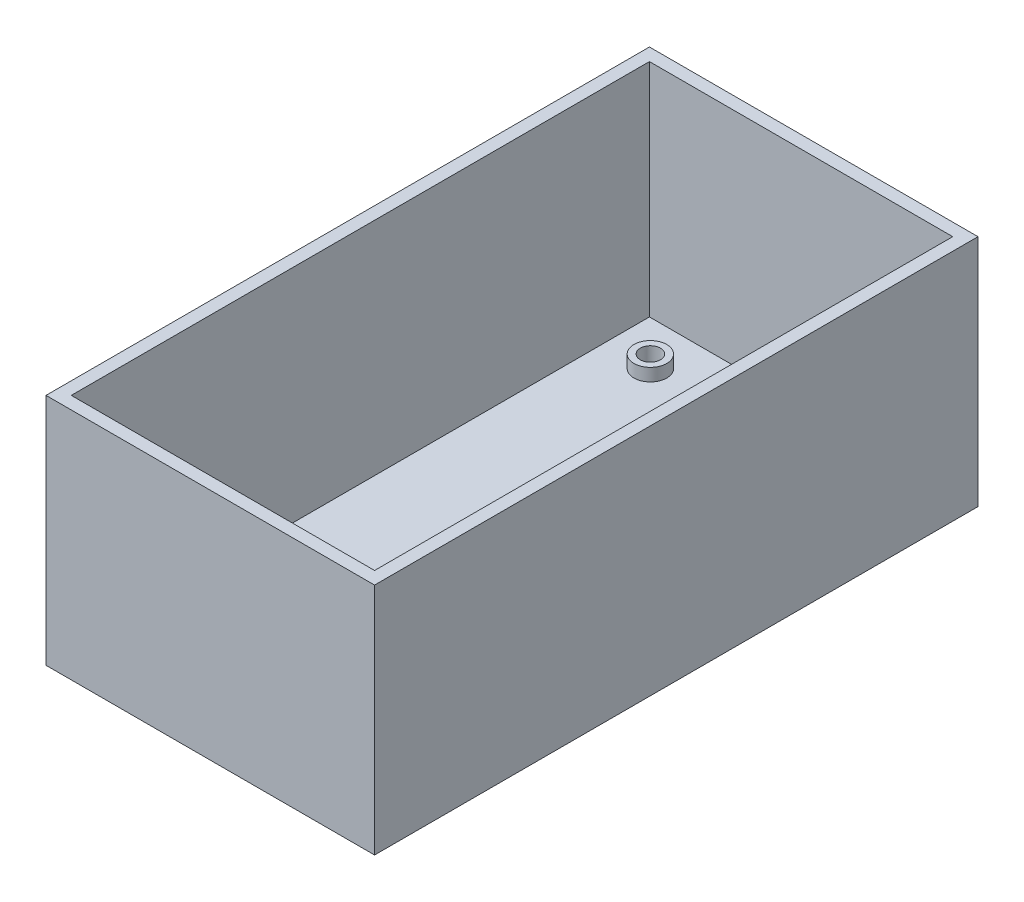
ISO-10303-21;
HEADER;
FILE_DESCRIPTION(('STEP AP214'),'2;1');
FILE_NAME('part.step','',(''),(''),'','','');
FILE_SCHEMA(('AUTOMOTIVE_DESIGN { 1 0 10303 214 1 1 1 1 }'));
ENDSEC;
DATA;
#1=APPLICATION_CONTEXT('core data for automotive mechanical design processes');
#2=APPLICATION_PROTOCOL_DEFINITION('international standard','automotive_design',2000,#1);
#3=PRODUCT_CONTEXT('',#1,'mechanical');
#4=PRODUCT('Part','Part','',(#3));
#5=PRODUCT_RELATED_PRODUCT_CATEGORY('part','',(#4));
#6=PRODUCT_DEFINITION_FORMATION('','',#4);
#7=PRODUCT_DEFINITION_CONTEXT('part definition',#1,'design');
#8=PRODUCT_DEFINITION('design','',#6,#7);
#9=PRODUCT_DEFINITION_SHAPE('','',#8);
#10=(LENGTH_UNIT() NAMED_UNIT(*) SI_UNIT(.MILLI.,.METRE.));
#11=(NAMED_UNIT(*) PLANE_ANGLE_UNIT() SI_UNIT($,.RADIAN.));
#12=(NAMED_UNIT(*) SI_UNIT($,.STERADIAN.) SOLID_ANGLE_UNIT());
#13=UNCERTAINTY_MEASURE_WITH_UNIT(LENGTH_MEASURE(1.E-05),#10,'distance_accuracy_value','');
#14=(GEOMETRIC_REPRESENTATION_CONTEXT(3) GLOBAL_UNCERTAINTY_ASSIGNED_CONTEXT((#13)) GLOBAL_UNIT_ASSIGNED_CONTEXT((#10,
#11,#12)) REPRESENTATION_CONTEXT('',''));
#15=CARTESIAN_POINT('',(0.,0.,0.));
#16=DIRECTION('',(0.,0.,1.));
#17=DIRECTION('',(1.,0.,0.));
#18=AXIS2_PLACEMENT_3D('',#15,#16,#17);
#19=CARTESIAN_POINT('',(26.,2.,-47.75));
#20=DIRECTION('',(-1.,0.,0.));
#21=DIRECTION('',(0.,0.,1.));
#22=AXIS2_PLACEMENT_3D('',#19,#20,#21);
#23=PLANE('',#22);
#24=DIRECTION('',(0.,0.,-1.));
#25=VECTOR('',#24,1.);
#26=CARTESIAN_POINT('',(26.,0.,-47.75));
#27=LINE('',#26,#25);
#28=CARTESIAN_POINT('',(26.,0.,47.75));
#29=VERTEX_POINT('',#28);
#30=CARTESIAN_POINT('',(26.,0.,-47.75));
#31=VERTEX_POINT('',#30);
#32=EDGE_CURVE('E185',#29,#31,#27,.T.);
#33=ORIENTED_EDGE('',*,*,#32,.T.);
#34=DIRECTION('',(0.,-1.,0.));
#35=VECTOR('',#34,1.);
#36=CARTESIAN_POINT('',(26.,2.,-47.75));
#37=LINE('',#36,#35);
#38=CARTESIAN_POINT('',(26.,37.,-47.75));
#39=VERTEX_POINT('',#38);
#40=EDGE_CURVE('E11',#39,#31,#37,.T.);
#41=ORIENTED_EDGE('',*,*,#40,.F.);
#42=DIRECTION('',(0.,0.,-1.));
#43=VECTOR('',#42,1.);
#44=CARTESIAN_POINT('',(26.,37.,47.75));
#45=LINE('',#44,#43);
#46=CARTESIAN_POINT('',(26.,37.,47.75));
#47=VERTEX_POINT('',#46);
#48=EDGE_CURVE('E157',#47,#39,#45,.T.);
#49=ORIENTED_EDGE('',*,*,#48,.F.);
#50=DIRECTION('',(0.,-1.,0.));
#51=VECTOR('',#50,1.);
#52=CARTESIAN_POINT('',(26.,2.,47.75));
#53=LINE('',#52,#51);
#54=EDGE_CURVE('E198',#47,#29,#53,.T.);
#55=ORIENTED_EDGE('',*,*,#54,.T.);
#56=EDGE_LOOP('',(#33,#41,#49,#55));
#57=FACE_BOUND('',#56,.T.);
#58=ADVANCED_FACE('F39',(#57),#23,.F.);
#59=CARTESIAN_POINT('',(-26.,2.,-47.75));
#60=DIRECTION('',(0.,0.,1.));
#61=DIRECTION('',(1.,0.,0.));
#62=AXIS2_PLACEMENT_3D('',#59,#60,#61);
#63=PLANE('',#62);
#64=DIRECTION('',(-1.,0.,0.));
#65=VECTOR('',#64,1.);
#66=CARTESIAN_POINT('',(-26.,0.,-47.75));
#67=LINE('',#66,#65);
#68=CARTESIAN_POINT('',(-26.,0.,-47.75));
#69=VERTEX_POINT('',#68);
#70=EDGE_CURVE('E189',#31,#69,#67,.T.);
#71=ORIENTED_EDGE('',*,*,#70,.T.);
#72=DIRECTION('',(0.,-1.,0.));
#73=VECTOR('',#72,1.);
#74=CARTESIAN_POINT('',(-26.,2.,-47.75));
#75=LINE('',#74,#73);
#76=CARTESIAN_POINT('',(-26.,37.,-47.75));
#77=VERTEX_POINT('',#76);
#78=EDGE_CURVE('E47',#77,#69,#75,.T.);
#79=ORIENTED_EDGE('',*,*,#78,.F.);
#80=DIRECTION('',(-1.,0.,0.));
#81=VECTOR('',#80,1.);
#82=CARTESIAN_POINT('',(26.,37.,-47.75));
#83=LINE('',#82,#81);
#84=EDGE_CURVE('E161',#39,#77,#83,.T.);
#85=ORIENTED_EDGE('',*,*,#84,.F.);
#86=ORIENTED_EDGE('',*,*,#40,.T.);
#87=EDGE_LOOP('',(#71,#79,#85,#86));
#88=FACE_BOUND('',#87,.T.);
#89=ADVANCED_FACE('F223',(#88),#63,.F.);
#90=CARTESIAN_POINT('',(-26.,2.,-47.75));
#91=DIRECTION('',(1.,0.,0.));
#92=DIRECTION('',(0.,0.,-1.));
#93=AXIS2_PLACEMENT_3D('',#90,#91,#92);
#94=PLANE('',#93);
#95=DIRECTION('',(0.,0.,1.));
#96=VECTOR('',#95,1.);
#97=CARTESIAN_POINT('',(-26.,0.,-47.75));
#98=LINE('',#97,#96);
#99=CARTESIAN_POINT('',(-26.,0.,47.75));
#100=VERTEX_POINT('',#99);
#101=EDGE_CURVE('E192',#69,#100,#98,.T.);
#102=ORIENTED_EDGE('',*,*,#101,.T.);
#103=DIRECTION('',(0.,-1.,0.));
#104=VECTOR('',#103,1.);
#105=CARTESIAN_POINT('',(-26.,2.,47.75));
#106=LINE('',#105,#104);
#107=CARTESIAN_POINT('',(-26.,37.,47.75));
#108=VERTEX_POINT('',#107);
#109=EDGE_CURVE('E202',#108,#100,#106,.T.);
#110=ORIENTED_EDGE('',*,*,#109,.F.);
#111=DIRECTION('',(0.,0.,1.));
#112=VECTOR('',#111,1.);
#113=CARTESIAN_POINT('',(-26.,37.,-47.75));
#114=LINE('',#113,#112);
#115=EDGE_CURVE('E165',#77,#108,#114,.T.);
#116=ORIENTED_EDGE('',*,*,#115,.F.);
#117=ORIENTED_EDGE('',*,*,#78,.T.);
#118=EDGE_LOOP('',(#102,#110,#116,#117));
#119=FACE_BOUND('',#118,.T.);
#120=ADVANCED_FACE('F210',(#119),#94,.F.);
#121=CARTESIAN_POINT('',(-26.,2.,47.75));
#122=DIRECTION('',(0.,0.,-1.));
#123=DIRECTION('',(-1.,0.,0.));
#124=AXIS2_PLACEMENT_3D('',#121,#122,#123);
#125=PLANE('',#124);
#126=DIRECTION('',(1.,0.,0.));
#127=VECTOR('',#126,1.);
#128=CARTESIAN_POINT('',(-26.,0.,47.75));
#129=LINE('',#128,#127);
#130=EDGE_CURVE('E195',#100,#29,#129,.T.);
#131=ORIENTED_EDGE('',*,*,#130,.T.);
#132=ORIENTED_EDGE('',*,*,#54,.F.);
#133=DIRECTION('',(1.,0.,0.));
#134=VECTOR('',#133,1.);
#135=CARTESIAN_POINT('',(-26.,37.,47.75));
#136=LINE('',#135,#134);
#137=EDGE_CURVE('E120',#108,#47,#136,.T.);
#138=ORIENTED_EDGE('',*,*,#137,.F.);
#139=ORIENTED_EDGE('',*,*,#109,.T.);
#140=EDGE_LOOP('',(#131,#132,#138,#139));
#141=FACE_BOUND('',#140,.T.);
#142=ADVANCED_FACE('F218',(#141),#125,.F.);
#143=CARTESIAN_POINT('',(0.,2.,0.));
#144=DIRECTION('',(0.,1.,0.));
#145=DIRECTION('',(0.,0.,1.));
#146=AXIS2_PLACEMENT_3D('',#143,#144,#145);
#147=PLANE('',#146);
#148=CARTESIAN_POINT('',(-16.85,2.,38.75));
#149=DIRECTION('',(0.,1.,0.));
#150=DIRECTION('',(0.,0.,1.));
#151=AXIS2_PLACEMENT_3D('',#148,#149,#150);
#152=CIRCLE('',#151,2.6);
#153=CARTESIAN_POINT('',(-16.85,2.,41.35));
#154=VERTEX_POINT('',#153);
#155=EDGE_CURVE('E318',#154,#154,#152,.T.);
#156=ORIENTED_EDGE('',*,*,#155,.F.);
#157=EDGE_LOOP('',(#156));
#158=FACE_BOUND('',#157,.T.);
#159=CARTESIAN_POINT('',(16.85,2.,38.75));
#160=DIRECTION('',(0.,1.,0.));
#161=DIRECTION('',(0.,0.,1.));
#162=AXIS2_PLACEMENT_3D('',#159,#160,#161);
#163=CIRCLE('',#162,2.6);
#164=CARTESIAN_POINT('',(16.85,2.,41.35));
#165=VERTEX_POINT('',#164);
#166=EDGE_CURVE('E311',#165,#165,#163,.T.);
#167=ORIENTED_EDGE('',*,*,#166,.F.);
#168=EDGE_LOOP('',(#167));
#169=FACE_BOUND('',#168,.T.);
#170=CARTESIAN_POINT('',(16.85,2.,-38.75));
#171=DIRECTION('',(0.,1.,0.));
#172=DIRECTION('',(0.,0.,1.));
#173=AXIS2_PLACEMENT_3D('',#170,#171,#172);
#174=CIRCLE('',#173,2.6);
#175=CARTESIAN_POINT('',(16.85,2.,-36.15));
#176=VERTEX_POINT('',#175);
#177=EDGE_CURVE('E330',#176,#176,#174,.T.);
#178=ORIENTED_EDGE('',*,*,#177,.F.);
#179=EDGE_LOOP('',(#178));
#180=FACE_BOUND('',#179,.T.);
#181=CARTESIAN_POINT('',(-16.85,2.,-38.75));
#182=DIRECTION('',(0.,1.,0.));
#183=DIRECTION('',(0.,0.,1.));
#184=AXIS2_PLACEMENT_3D('',#181,#182,#183);
#185=CIRCLE('',#184,2.6);
#186=CARTESIAN_POINT('',(-16.85,2.,-36.15));
#187=VERTEX_POINT('',#186);
#188=EDGE_CURVE('E340',#187,#187,#185,.T.);
#189=ORIENTED_EDGE('',*,*,#188,.F.);
#190=EDGE_LOOP('',(#189));
#191=FACE_BOUND('',#190,.T.);
#192=DIRECTION('',(1.,0.,0.));
#193=VECTOR('',#192,1.);
#194=CARTESIAN_POINT('',(-24.,2.,45.75));
#195=LINE('',#194,#193);
#196=CARTESIAN_POINT('',(-24.,2.,45.75));
#197=VERTEX_POINT('',#196);
#198=CARTESIAN_POINT('',(24.,2.,45.75));
#199=VERTEX_POINT('',#198);
#200=EDGE_CURVE('E54',#197,#199,#195,.T.);
#201=ORIENTED_EDGE('',*,*,#200,.T.);
#202=DIRECTION('',(0.,0.,-1.));
#203=VECTOR('',#202,1.);
#204=CARTESIAN_POINT('',(24.,2.,45.75));
#205=LINE('',#204,#203);
#206=CARTESIAN_POINT('',(24.,2.,-45.75));
#207=VERTEX_POINT('',#206);
#208=EDGE_CURVE('E58',#199,#207,#205,.T.);
#209=ORIENTED_EDGE('',*,*,#208,.T.);
#210=DIRECTION('',(-1.,0.,0.));
#211=VECTOR('',#210,1.);
#212=CARTESIAN_POINT('',(24.,2.,-45.75));
#213=LINE('',#212,#211);
#214=CARTESIAN_POINT('',(-24.,2.,-45.75));
#215=VERTEX_POINT('',#214);
#216=EDGE_CURVE('E141',#207,#215,#213,.T.);
#217=ORIENTED_EDGE('',*,*,#216,.T.);
#218=DIRECTION('',(0.,0.,1.));
#219=VECTOR('',#218,1.);
#220=CARTESIAN_POINT('',(-24.,2.,-45.75));
#221=LINE('',#220,#219);
#222=EDGE_CURVE('E114',#215,#197,#221,.T.);
#223=ORIENTED_EDGE('',*,*,#222,.T.);
#224=EDGE_LOOP('',(#201,#209,#217,#223));
#225=FACE_BOUND('',#224,.T.);
#226=ADVANCED_FACE('F233',(#158,#169,#180,#191,#225),#147,.T.);
#227=CARTESIAN_POINT('',(0.,0.,0.));
#228=DIRECTION('',(0.,1.,0.));
#229=DIRECTION('',(0.,0.,1.));
#230=AXIS2_PLACEMENT_3D('',#227,#228,#229);
#231=PLANE('',#230);
#232=CARTESIAN_POINT('',(16.85,0.,-38.75));
#233=DIRECTION('',(0.,1.,0.));
#234=DIRECTION('',(0.,0.,1.));
#235=AXIS2_PLACEMENT_3D('',#232,#233,#234);
#236=CIRCLE('',#235,1.6);
#237=CARTESIAN_POINT('',(16.85,0.,-37.15));
#238=VERTEX_POINT('',#237);
#239=EDGE_CURVE('E174',#238,#238,#236,.T.);
#240=ORIENTED_EDGE('',*,*,#239,.T.);
#241=EDGE_LOOP('',(#240));
#242=FACE_BOUND('',#241,.T.);
#243=CARTESIAN_POINT('',(-16.85,0.,38.75));
#244=DIRECTION('',(0.,1.,0.));
#245=DIRECTION('',(0.,0.,1.));
#246=AXIS2_PLACEMENT_3D('',#243,#244,#245);
#247=CIRCLE('',#246,1.6);
#248=CARTESIAN_POINT('',(-16.85,0.,40.35));
#249=VERTEX_POINT('',#248);
#250=EDGE_CURVE('E173',#249,#249,#247,.T.);
#251=ORIENTED_EDGE('',*,*,#250,.T.);
#252=EDGE_LOOP('',(#251));
#253=FACE_BOUND('',#252,.T.);
#254=CARTESIAN_POINT('',(16.85,0.,38.75));
#255=DIRECTION('',(0.,1.,0.));
#256=DIRECTION('',(0.,0.,1.));
#257=AXIS2_PLACEMENT_3D('',#254,#255,#256);
#258=CIRCLE('',#257,1.6);
#259=CARTESIAN_POINT('',(16.85,0.,40.35));
#260=VERTEX_POINT('',#259);
#261=EDGE_CURVE('E169',#260,#260,#258,.T.);
#262=ORIENTED_EDGE('',*,*,#261,.T.);
#263=EDGE_LOOP('',(#262));
#264=FACE_BOUND('',#263,.T.);
#265=CARTESIAN_POINT('',(-16.85,0.,-38.75));
#266=DIRECTION('',(0.,1.,0.));
#267=DIRECTION('',(0.,0.,1.));
#268=AXIS2_PLACEMENT_3D('',#265,#266,#267);
#269=CIRCLE('',#268,1.6);
#270=CARTESIAN_POINT('',(-16.85,0.,-37.15));
#271=VERTEX_POINT('',#270);
#272=EDGE_CURVE('E178',#271,#271,#269,.T.);
#273=ORIENTED_EDGE('',*,*,#272,.T.);
#274=EDGE_LOOP('',(#273));
#275=FACE_BOUND('',#274,.T.);
#276=ORIENTED_EDGE('',*,*,#32,.F.);
#277=ORIENTED_EDGE('',*,*,#130,.F.);
#278=ORIENTED_EDGE('',*,*,#101,.F.);
#279=ORIENTED_EDGE('',*,*,#70,.F.);
#280=EDGE_LOOP('',(#276,#277,#278,#279));
#281=FACE_BOUND('',#280,.T.);
#282=ADVANCED_FACE('F216',(#242,#253,#264,#275,#281),#231,.F.);
#283=CARTESIAN_POINT('',(-16.85,0.,-38.75));
#284=DIRECTION('',(0.,1.,0.));
#285=DIRECTION('',(0.,0.,1.));
#286=AXIS2_PLACEMENT_3D('',#283,#284,#285);
#287=CYLINDRICAL_SURFACE('',#286,1.6);
#288=ORIENTED_EDGE('',*,*,#272,.F.);
#289=EDGE_LOOP('',(#288));
#290=FACE_BOUND('',#289,.T.);
#291=CARTESIAN_POINT('',(-16.85,4.,-38.75));
#292=DIRECTION('',(0.,1.,0.));
#293=DIRECTION('',(0.,0.,1.));
#294=AXIS2_PLACEMENT_3D('',#291,#292,#293);
#295=CIRCLE('',#294,1.6);
#296=CARTESIAN_POINT('',(-16.85,4.,-37.15));
#297=VERTEX_POINT('',#296);
#298=EDGE_CURVE('E344',#297,#297,#295,.F.);
#299=ORIENTED_EDGE('',*,*,#298,.F.);
#300=EDGE_LOOP('',(#299));
#301=FACE_BOUND('',#300,.T.);
#302=ADVANCED_FACE('F236',(#290,#301),#287,.F.);
#303=CARTESIAN_POINT('',(16.85,0.,38.75));
#304=DIRECTION('',(0.,1.,0.));
#305=DIRECTION('',(0.,0.,1.));
#306=AXIS2_PLACEMENT_3D('',#303,#304,#305);
#307=CYLINDRICAL_SURFACE('',#306,1.6);
#308=ORIENTED_EDGE('',*,*,#261,.F.);
#309=EDGE_LOOP('',(#308));
#310=FACE_BOUND('',#309,.T.);
#311=CARTESIAN_POINT('',(16.85,4.,38.75));
#312=DIRECTION('',(0.,1.,0.));
#313=DIRECTION('',(0.,0.,1.));
#314=AXIS2_PLACEMENT_3D('',#311,#312,#313);
#315=CIRCLE('',#314,1.6);
#316=CARTESIAN_POINT('',(16.85,4.,40.35));
#317=VERTEX_POINT('',#316);
#318=EDGE_CURVE('E316',#317,#317,#315,.F.);
#319=ORIENTED_EDGE('',*,*,#318,.F.);
#320=EDGE_LOOP('',(#319));
#321=FACE_BOUND('',#320,.T.);
#322=ADVANCED_FACE('F243',(#310,#321),#307,.F.);
#323=CARTESIAN_POINT('',(-16.85,0.,38.75));
#324=DIRECTION('',(0.,1.,0.));
#325=DIRECTION('',(0.,0.,1.));
#326=AXIS2_PLACEMENT_3D('',#323,#324,#325);
#327=CYLINDRICAL_SURFACE('',#326,1.6);
#328=ORIENTED_EDGE('',*,*,#250,.F.);
#329=EDGE_LOOP('',(#328));
#330=FACE_BOUND('',#329,.T.);
#331=CARTESIAN_POINT('',(-16.85,4.,38.75));
#332=DIRECTION('',(0.,1.,0.));
#333=DIRECTION('',(0.,0.,1.));
#334=AXIS2_PLACEMENT_3D('',#331,#332,#333);
#335=CIRCLE('',#334,1.6);
#336=CARTESIAN_POINT('',(-16.85,4.,40.35));
#337=VERTEX_POINT('',#336);
#338=EDGE_CURVE('E306',#337,#337,#335,.F.);
#339=ORIENTED_EDGE('',*,*,#338,.F.);
#340=EDGE_LOOP('',(#339));
#341=FACE_BOUND('',#340,.T.);
#342=ADVANCED_FACE('F245',(#330,#341),#327,.F.);
#343=CARTESIAN_POINT('',(16.85,0.,-38.75));
#344=DIRECTION('',(0.,1.,0.));
#345=DIRECTION('',(0.,0.,1.));
#346=AXIS2_PLACEMENT_3D('',#343,#344,#345);
#347=CYLINDRICAL_SURFACE('',#346,1.6);
#348=ORIENTED_EDGE('',*,*,#239,.F.);
#349=EDGE_LOOP('',(#348));
#350=FACE_BOUND('',#349,.T.);
#351=CARTESIAN_POINT('',(16.85,4.,-38.75));
#352=DIRECTION('',(0.,1.,0.));
#353=DIRECTION('',(0.,0.,1.));
#354=AXIS2_PLACEMENT_3D('',#351,#352,#353);
#355=CIRCLE('',#354,1.6);
#356=CARTESIAN_POINT('',(16.85,4.,-37.15));
#357=VERTEX_POINT('',#356);
#358=EDGE_CURVE('E332',#357,#357,#355,.F.);
#359=ORIENTED_EDGE('',*,*,#358,.F.);
#360=EDGE_LOOP('',(#359));
#361=FACE_BOUND('',#360,.T.);
#362=ADVANCED_FACE('F248',(#350,#361),#347,.F.);
#363=CARTESIAN_POINT('',(0.,37.,0.));
#364=DIRECTION('',(0.,1.,0.));
#365=DIRECTION('',(0.,0.,1.));
#366=AXIS2_PLACEMENT_3D('',#363,#364,#365);
#367=PLANE('',#366);
#368=ORIENTED_EDGE('',*,*,#137,.T.);
#369=ORIENTED_EDGE('',*,*,#48,.T.);
#370=ORIENTED_EDGE('',*,*,#84,.T.);
#371=ORIENTED_EDGE('',*,*,#115,.T.);
#372=EDGE_LOOP('',(#368,#369,#370,#371));
#373=FACE_BOUND('',#372,.T.);
#374=DIRECTION('',(0.,0.,-1.));
#375=VECTOR('',#374,1.);
#376=CARTESIAN_POINT('',(24.,37.,45.75));
#377=LINE('',#376,#375);
#378=CARTESIAN_POINT('',(24.,37.,45.75));
#379=VERTEX_POINT('',#378);
#380=CARTESIAN_POINT('',(24.,37.,-45.75));
#381=VERTEX_POINT('',#380);
#382=EDGE_CURVE('E113',#379,#381,#377,.T.);
#383=ORIENTED_EDGE('',*,*,#382,.F.);
#384=DIRECTION('',(1.,0.,0.));
#385=VECTOR('',#384,1.);
#386=CARTESIAN_POINT('',(-24.,37.,45.75));
#387=LINE('',#386,#385);
#388=CARTESIAN_POINT('',(-24.,37.,45.75));
#389=VERTEX_POINT('',#388);
#390=EDGE_CURVE('E103',#389,#379,#387,.T.);
#391=ORIENTED_EDGE('',*,*,#390,.F.);
#392=DIRECTION('',(0.,0.,1.));
#393=VECTOR('',#392,1.);
#394=CARTESIAN_POINT('',(-24.,37.,-45.75));
#395=LINE('',#394,#393);
#396=CARTESIAN_POINT('',(-24.,37.,-45.75));
#397=VERTEX_POINT('',#396);
#398=EDGE_CURVE('E130',#397,#389,#395,.T.);
#399=ORIENTED_EDGE('',*,*,#398,.F.);
#400=DIRECTION('',(-1.,0.,0.));
#401=VECTOR('',#400,1.);
#402=CARTESIAN_POINT('',(24.,37.,-45.75));
#403=LINE('',#402,#401);
#404=EDGE_CURVE('E126',#381,#397,#403,.T.);
#405=ORIENTED_EDGE('',*,*,#404,.F.);
#406=EDGE_LOOP('',(#383,#391,#399,#405));
#407=FACE_BOUND('',#406,.T.);
#408=ADVANCED_FACE('F124',(#373,#407),#367,.T.);
#409=CARTESIAN_POINT('',(-24.,37.,45.75));
#410=DIRECTION('',(0.,0.,-1.));
#411=DIRECTION('',(-1.,0.,0.));
#412=AXIS2_PLACEMENT_3D('',#409,#410,#411);
#413=PLANE('',#412);
#414=ORIENTED_EDGE('',*,*,#200,.F.);
#415=DIRECTION('',(0.,-1.,0.));
#416=VECTOR('',#415,1.);
#417=CARTESIAN_POINT('',(-24.,37.,45.75));
#418=LINE('',#417,#416);
#419=EDGE_CURVE('E108',#389,#197,#418,.T.);
#420=ORIENTED_EDGE('',*,*,#419,.F.);
#421=ORIENTED_EDGE('',*,*,#390,.T.);
#422=DIRECTION('',(0.,-1.,0.));
#423=VECTOR('',#422,1.);
#424=CARTESIAN_POINT('',(24.,37.,45.75));
#425=LINE('',#424,#423);
#426=EDGE_CURVE('E106',#379,#199,#425,.T.);
#427=ORIENTED_EDGE('',*,*,#426,.T.);
#428=EDGE_LOOP('',(#414,#420,#421,#427));
#429=FACE_BOUND('',#428,.T.);
#430=ADVANCED_FACE('F105',(#429),#413,.T.);
#431=CARTESIAN_POINT('',(24.,37.,45.75));
#432=DIRECTION('',(-1.,0.,0.));
#433=DIRECTION('',(0.,0.,1.));
#434=AXIS2_PLACEMENT_3D('',#431,#432,#433);
#435=PLANE('',#434);
#436=ORIENTED_EDGE('',*,*,#208,.F.);
#437=ORIENTED_EDGE('',*,*,#426,.F.);
#438=ORIENTED_EDGE('',*,*,#382,.T.);
#439=DIRECTION('',(0.,-1.,0.));
#440=VECTOR('',#439,1.);
#441=CARTESIAN_POINT('',(24.,37.,-45.75));
#442=LINE('',#441,#440);
#443=EDGE_CURVE('E121',#381,#207,#442,.T.);
#444=ORIENTED_EDGE('',*,*,#443,.T.);
#445=EDGE_LOOP('',(#436,#437,#438,#444));
#446=FACE_BOUND('',#445,.T.);
#447=ADVANCED_FACE('F117',(#446),#435,.T.);
#448=CARTESIAN_POINT('',(24.,37.,-45.75));
#449=DIRECTION('',(0.,0.,1.));
#450=DIRECTION('',(1.,0.,0.));
#451=AXIS2_PLACEMENT_3D('',#448,#449,#450);
#452=PLANE('',#451);
#453=ORIENTED_EDGE('',*,*,#216,.F.);
#454=ORIENTED_EDGE('',*,*,#443,.F.);
#455=ORIENTED_EDGE('',*,*,#404,.T.);
#456=DIRECTION('',(0.,-1.,0.));
#457=VECTOR('',#456,1.);
#458=CARTESIAN_POINT('',(-24.,37.,-45.75));
#459=LINE('',#458,#457);
#460=EDGE_CURVE('E148',#397,#215,#459,.T.);
#461=ORIENTED_EDGE('',*,*,#460,.T.);
#462=EDGE_LOOP('',(#453,#454,#455,#461));
#463=FACE_BOUND('',#462,.T.);
#464=ADVANCED_FACE('F262',(#463),#452,.T.);
#465=CARTESIAN_POINT('',(-24.,37.,-45.75));
#466=DIRECTION('',(1.,0.,0.));
#467=DIRECTION('',(0.,0.,-1.));
#468=AXIS2_PLACEMENT_3D('',#465,#466,#467);
#469=PLANE('',#468);
#470=ORIENTED_EDGE('',*,*,#222,.F.);
#471=ORIENTED_EDGE('',*,*,#460,.F.);
#472=ORIENTED_EDGE('',*,*,#398,.T.);
#473=ORIENTED_EDGE('',*,*,#419,.T.);
#474=EDGE_LOOP('',(#470,#471,#472,#473));
#475=FACE_BOUND('',#474,.T.);
#476=ADVANCED_FACE('F265',(#475),#469,.T.);
#477=CARTESIAN_POINT('',(-16.85,4.,-38.75));
#478=DIRECTION('',(0.,-1.,0.));
#479=DIRECTION('',(0.,0.,-1.));
#480=AXIS2_PLACEMENT_3D('',#477,#478,#479);
#481=CYLINDRICAL_SURFACE('',#480,2.6);
#482=CARTESIAN_POINT('',(-16.85,4.,-38.75));
#483=DIRECTION('',(0.,1.,0.));
#484=DIRECTION('',(0.,0.,1.));
#485=AXIS2_PLACEMENT_3D('',#482,#483,#484);
#486=CIRCLE('',#485,2.6);
#487=CARTESIAN_POINT('',(-16.85,4.,-36.15));
#488=VERTEX_POINT('',#487);
#489=EDGE_CURVE('E138',#488,#488,#486,.T.);
#490=ORIENTED_EDGE('',*,*,#489,.F.);
#491=EDGE_LOOP('',(#490));
#492=FACE_BOUND('',#491,.T.);
#493=ORIENTED_EDGE('',*,*,#188,.T.);
#494=EDGE_LOOP('',(#493));
#495=FACE_BOUND('',#494,.T.);
#496=ADVANCED_FACE('F269',(#492,#495),#481,.T.);
#497=CARTESIAN_POINT('',(0.,4.,0.));
#498=DIRECTION('',(0.,1.,0.));
#499=DIRECTION('',(0.,0.,1.));
#500=AXIS2_PLACEMENT_3D('',#497,#498,#499);
#501=PLANE('',#500);
#502=ORIENTED_EDGE('',*,*,#298,.T.);
#503=EDGE_LOOP('',(#502));
#504=FACE_BOUND('',#503,.T.);
#505=ORIENTED_EDGE('',*,*,#489,.T.);
#506=EDGE_LOOP('',(#505));
#507=FACE_BOUND('',#506,.T.);
#508=ADVANCED_FACE('F273',(#504,#507),#501,.T.);
#509=CARTESIAN_POINT('',(16.85,4.,-38.75));
#510=DIRECTION('',(0.,-1.,0.));
#511=DIRECTION('',(0.,0.,-1.));
#512=AXIS2_PLACEMENT_3D('',#509,#510,#511);
#513=CYLINDRICAL_SURFACE('',#512,2.6);
#514=CARTESIAN_POINT('',(16.85,4.,-38.75));
#515=DIRECTION('',(0.,1.,0.));
#516=DIRECTION('',(0.,0.,1.));
#517=AXIS2_PLACEMENT_3D('',#514,#515,#516);
#518=CIRCLE('',#517,2.6);
#519=CARTESIAN_POINT('',(16.85,4.,-36.15));
#520=VERTEX_POINT('',#519);
#521=EDGE_CURVE('E336',#520,#520,#518,.T.);
#522=ORIENTED_EDGE('',*,*,#521,.F.);
#523=EDGE_LOOP('',(#522));
#524=FACE_BOUND('',#523,.T.);
#525=ORIENTED_EDGE('',*,*,#177,.T.);
#526=EDGE_LOOP('',(#525));
#527=FACE_BOUND('',#526,.T.);
#528=ADVANCED_FACE('F277',(#524,#527),#513,.T.);
#529=CARTESIAN_POINT('',(0.,4.,0.));
#530=DIRECTION('',(0.,1.,0.));
#531=DIRECTION('',(0.,0.,1.));
#532=AXIS2_PLACEMENT_3D('',#529,#530,#531);
#533=PLANE('',#532);
#534=ORIENTED_EDGE('',*,*,#358,.T.);
#535=EDGE_LOOP('',(#534));
#536=FACE_BOUND('',#535,.T.);
#537=ORIENTED_EDGE('',*,*,#521,.T.);
#538=EDGE_LOOP('',(#537));
#539=FACE_BOUND('',#538,.T.);
#540=ADVANCED_FACE('F281',(#536,#539),#533,.T.);
#541=CARTESIAN_POINT('',(16.85,4.,38.75));
#542=DIRECTION('',(0.,-1.,0.));
#543=DIRECTION('',(0.,0.,-1.));
#544=AXIS2_PLACEMENT_3D('',#541,#542,#543);
#545=CYLINDRICAL_SURFACE('',#544,2.6);
#546=CARTESIAN_POINT('',(16.85,4.,38.75));
#547=DIRECTION('',(0.,1.,0.));
#548=DIRECTION('',(0.,0.,1.));
#549=AXIS2_PLACEMENT_3D('',#546,#547,#548);
#550=CIRCLE('',#549,2.6);
#551=CARTESIAN_POINT('',(16.85,4.,41.35));
#552=VERTEX_POINT('',#551);
#553=EDGE_CURVE('E327',#552,#552,#550,.T.);
#554=ORIENTED_EDGE('',*,*,#553,.F.);
#555=EDGE_LOOP('',(#554));
#556=FACE_BOUND('',#555,.T.);
#557=ORIENTED_EDGE('',*,*,#166,.T.);
#558=EDGE_LOOP('',(#557));
#559=FACE_BOUND('',#558,.T.);
#560=ADVANCED_FACE('F285',(#556,#559),#545,.T.);
#561=CARTESIAN_POINT('',(0.,4.,0.));
#562=DIRECTION('',(0.,1.,0.));
#563=DIRECTION('',(0.,0.,1.));
#564=AXIS2_PLACEMENT_3D('',#561,#562,#563);
#565=PLANE('',#564);
#566=ORIENTED_EDGE('',*,*,#318,.T.);
#567=EDGE_LOOP('',(#566));
#568=FACE_BOUND('',#567,.T.);
#569=ORIENTED_EDGE('',*,*,#553,.T.);
#570=EDGE_LOOP('',(#569));
#571=FACE_BOUND('',#570,.T.);
#572=ADVANCED_FACE('F289',(#568,#571),#565,.T.);
#573=CARTESIAN_POINT('',(-16.85,4.,38.75));
#574=DIRECTION('',(0.,-1.,0.));
#575=DIRECTION('',(0.,0.,-1.));
#576=AXIS2_PLACEMENT_3D('',#573,#574,#575);
#577=CYLINDRICAL_SURFACE('',#576,2.6);
#578=CARTESIAN_POINT('',(-16.85,4.,38.75));
#579=DIRECTION('',(0.,1.,0.));
#580=DIRECTION('',(0.,0.,1.));
#581=AXIS2_PLACEMENT_3D('',#578,#579,#580);
#582=CIRCLE('',#581,2.6);
#583=CARTESIAN_POINT('',(-16.85,4.,41.35));
#584=VERTEX_POINT('',#583);
#585=EDGE_CURVE('E309',#584,#584,#582,.T.);
#586=ORIENTED_EDGE('',*,*,#585,.F.);
#587=EDGE_LOOP('',(#586));
#588=FACE_BOUND('',#587,.T.);
#589=ORIENTED_EDGE('',*,*,#155,.T.);
#590=EDGE_LOOP('',(#589));
#591=FACE_BOUND('',#590,.T.);
#592=ADVANCED_FACE('F293',(#588,#591),#577,.T.);
#593=CARTESIAN_POINT('',(0.,4.,0.));
#594=DIRECTION('',(0.,1.,0.));
#595=DIRECTION('',(0.,0.,1.));
#596=AXIS2_PLACEMENT_3D('',#593,#594,#595);
#597=PLANE('',#596);
#598=ORIENTED_EDGE('',*,*,#338,.T.);
#599=EDGE_LOOP('',(#598));
#600=FACE_BOUND('',#599,.T.);
#601=ORIENTED_EDGE('',*,*,#585,.T.);
#602=EDGE_LOOP('',(#601));
#603=FACE_BOUND('',#602,.T.);
#604=ADVANCED_FACE('F297',(#600,#603),#597,.T.);
#605=CLOSED_SHELL('',(#58,#89,#120,#142,#226,#282,#302,#322,#342,#362,#408,#430,#447,#464,#476,
#496,#508,#528,#540,#560,#572,#592,#604));
#606=MANIFOLD_SOLID_BREP('B2',#605);
#607=ADVANCED_BREP_SHAPE_REPRESENTATION('',(#18,#606),#14);
#608=SHAPE_DEFINITION_REPRESENTATION(#9,#607);
ENDSEC;
END-ISO-10303-21;
